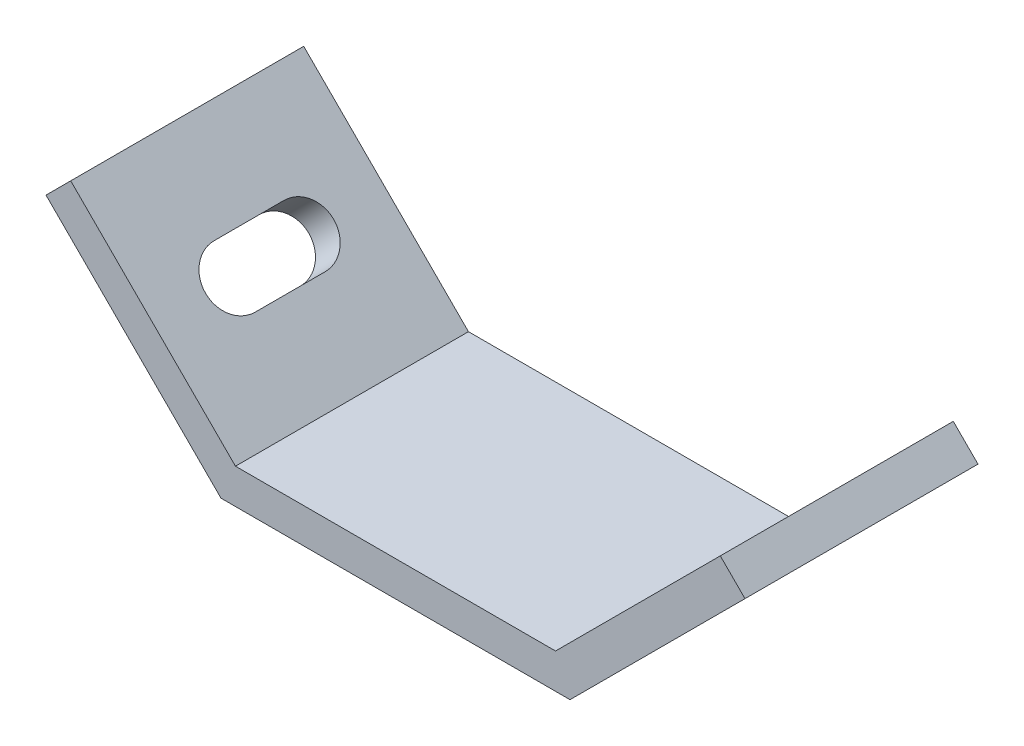
ISO-10303-21;
HEADER;
FILE_DESCRIPTION(('STEP AP214'),'2;1');
FILE_NAME('part.step','',(''),(''),'','','');
FILE_SCHEMA(('AUTOMOTIVE_DESIGN { 1 0 10303 214 1 1 1 1 }'));
ENDSEC;
DATA;
#1=APPLICATION_CONTEXT('core data for automotive mechanical design processes');
#2=APPLICATION_PROTOCOL_DEFINITION('international standard','automotive_design',2000,#1);
#3=PRODUCT_CONTEXT('',#1,'mechanical');
#4=PRODUCT('Part','Part','',(#3));
#5=PRODUCT_RELATED_PRODUCT_CATEGORY('part','',(#4));
#6=PRODUCT_DEFINITION_FORMATION('','',#4);
#7=PRODUCT_DEFINITION_CONTEXT('part definition',#1,'design');
#8=PRODUCT_DEFINITION('design','',#6,#7);
#9=PRODUCT_DEFINITION_SHAPE('','',#8);
#10=(LENGTH_UNIT() NAMED_UNIT(*) SI_UNIT(.MILLI.,.METRE.));
#11=(NAMED_UNIT(*) PLANE_ANGLE_UNIT() SI_UNIT($,.RADIAN.));
#12=(NAMED_UNIT(*) SI_UNIT($,.STERADIAN.) SOLID_ANGLE_UNIT());
#13=UNCERTAINTY_MEASURE_WITH_UNIT(LENGTH_MEASURE(1.E-05),#10,'distance_accuracy_value','');
#14=(GEOMETRIC_REPRESENTATION_CONTEXT(3) GLOBAL_UNCERTAINTY_ASSIGNED_CONTEXT((#13)) GLOBAL_UNIT_ASSIGNED_CONTEXT((#10,
#11,#12)) REPRESENTATION_CONTEXT('',''));
#15=CARTESIAN_POINT('',(0.,0.,0.));
#16=DIRECTION('',(0.,0.,1.));
#17=DIRECTION('',(1.,0.,0.));
#18=AXIS2_PLACEMENT_3D('',#15,#16,#17);
#19=CARTESIAN_POINT('',(15.8578643762691,-2.12132034355965,20.));
#20=DIRECTION('',(-0.707106781186546,0.707106781186549,0.));
#21=DIRECTION('',(-0.707106781186549,-0.707106781186546,0.));
#22=AXIS2_PLACEMENT_3D('',#19,#20,#21);
#23=PLANE('',#22);
#24=DIRECTION('',(0.707106781186549,0.707106781186546,0.));
#25=VECTOR('',#24,1.);
#26=CARTESIAN_POINT('',(15.8578643762691,-2.12132034355965,0.));
#27=LINE('',#26,#25);
#28=CARTESIAN_POINT('',(14.9791847198287,-3.,0.));
#29=VERTEX_POINT('',#28);
#30=CARTESIAN_POINT('',(30.,12.0208152801712,0.));
#31=VERTEX_POINT('',#30);
#32=EDGE_CURVE('E175',#29,#31,#27,.T.);
#33=ORIENTED_EDGE('',*,*,#32,.T.);
#34=DIRECTION('',(0.,0.,-1.));
#35=VECTOR('',#34,1.);
#36=CARTESIAN_POINT('',(30.,12.0208152801712,20.));
#37=LINE('',#36,#35);
#38=CARTESIAN_POINT('',(30.,12.0208152801712,20.));
#39=VERTEX_POINT('',#38);
#40=EDGE_CURVE('E240',#39,#31,#37,.T.);
#41=ORIENTED_EDGE('',*,*,#40,.F.);
#42=DIRECTION('',(0.707106781186549,0.707106781186546,0.));
#43=VECTOR('',#42,1.);
#44=CARTESIAN_POINT('',(15.8578643762691,-2.12132034355965,20.));
#45=LINE('',#44,#43);
#46=CARTESIAN_POINT('',(14.9791847198287,-3.,20.));
#47=VERTEX_POINT('',#46);
#48=EDGE_CURVE('E182',#47,#39,#45,.T.);
#49=ORIENTED_EDGE('',*,*,#48,.F.);
#50=DIRECTION('',(0.,0.,-1.));
#51=VECTOR('',#50,1.);
#52=CARTESIAN_POINT('',(14.9791847198287,-3.,20.));
#53=LINE('',#52,#51);
#54=EDGE_CURVE('E204',#47,#29,#53,.T.);
#55=ORIENTED_EDGE('',*,*,#54,.T.);
#56=EDGE_LOOP('',(#33,#41,#49,#55));
#57=FACE_BOUND('',#56,.T.);
#58=CARTESIAN_POINT('',(22.9289321881345,4.94974746830579,7.));
#59=DIRECTION('',(-0.707106781186546,0.707106781186549,0.));
#60=DIRECTION('',(-0.707106781186549,-0.707106781186546,0.));
#61=AXIS2_PLACEMENT_3D('',#58,#59,#60);
#62=CIRCLE('',#61,2.5);
#63=CARTESIAN_POINT('',(21.1611652351682,3.18198051533942,7.));
#64=VERTEX_POINT('',#63);
#65=CARTESIAN_POINT('',(24.6966991411009,6.71751442127216,7.));
#66=VERTEX_POINT('',#65);
#67=EDGE_CURVE('E159',#64,#66,#62,.F.);
#68=ORIENTED_EDGE('',*,*,#67,.F.);
#69=DIRECTION('',(0.,0.,-1.));
#70=VECTOR('',#69,1.);
#71=CARTESIAN_POINT('',(21.1611652351682,3.18198051533942,20.));
#72=LINE('',#71,#70);
#73=CARTESIAN_POINT('',(21.1611652351682,3.18198051533942,13.));
#74=VERTEX_POINT('',#73);
#75=EDGE_CURVE('E152',#74,#64,#72,.T.);
#76=ORIENTED_EDGE('',*,*,#75,.F.);
#77=CARTESIAN_POINT('',(22.9289321881345,4.94974746830579,13.));
#78=DIRECTION('',(-0.707106781186546,0.707106781186549,0.));
#79=DIRECTION('',(-0.707106781186549,-0.707106781186546,0.));
#80=AXIS2_PLACEMENT_3D('',#77,#78,#79);
#81=CIRCLE('',#80,2.5);
#82=CARTESIAN_POINT('',(24.6966991411009,6.71751442127216,13.));
#83=VERTEX_POINT('',#82);
#84=EDGE_CURVE('E133',#83,#74,#81,.F.);
#85=ORIENTED_EDGE('',*,*,#84,.F.);
#86=DIRECTION('',(0.,0.,1.));
#87=VECTOR('',#86,1.);
#88=CARTESIAN_POINT('',(24.6966991411009,6.71751442127216,20.));
#89=LINE('',#88,#87);
#90=EDGE_CURVE('E157',#66,#83,#89,.T.);
#91=ORIENTED_EDGE('',*,*,#90,.F.);
#92=EDGE_LOOP('',(#68,#76,#85,#91));
#93=FACE_BOUND('',#92,.T.);
#94=ADVANCED_FACE('F15',(#57,#93),#23,.F.);
#95=CARTESIAN_POINT('',(13.7365440327094,0.,20.));
#96=DIRECTION('',(-0.707106781186546,0.707106781186549,0.));
#97=DIRECTION('',(-0.707106781186549,-0.707106781186546,0.));
#98=AXIS2_PLACEMENT_3D('',#95,#96,#97);
#99=PLANE('',#98);
#100=DIRECTION('',(0.707106781186549,0.707106781186546,0.));
#101=VECTOR('',#100,1.);
#102=CARTESIAN_POINT('',(13.7365440327094,0.,0.));
#103=LINE('',#102,#101);
#104=CARTESIAN_POINT('',(13.7365440327094,0.,0.));
#105=VERTEX_POINT('',#104);
#106=CARTESIAN_POINT('',(27.8786796564404,14.1421356237309,0.));
#107=VERTEX_POINT('',#106);
#108=EDGE_CURVE('E210',#105,#107,#103,.T.);
#109=ORIENTED_EDGE('',*,*,#108,.F.);
#110=DIRECTION('',(0.,0.,-1.));
#111=VECTOR('',#110,1.);
#112=CARTESIAN_POINT('',(13.7365440327094,0.,20.));
#113=LINE('',#112,#111);
#114=CARTESIAN_POINT('',(13.7365440327094,0.,20.));
#115=VERTEX_POINT('',#114);
#116=EDGE_CURVE('E236',#115,#105,#113,.T.);
#117=ORIENTED_EDGE('',*,*,#116,.F.);
#118=DIRECTION('',(0.707106781186549,0.707106781186546,0.));
#119=VECTOR('',#118,1.);
#120=CARTESIAN_POINT('',(13.7365440327094,0.,20.));
#121=LINE('',#120,#119);
#122=CARTESIAN_POINT('',(27.8786796564404,14.1421356237309,20.));
#123=VERTEX_POINT('',#122);
#124=EDGE_CURVE('E188',#115,#123,#121,.T.);
#125=ORIENTED_EDGE('',*,*,#124,.T.);
#126=DIRECTION('',(0.,0.,-1.));
#127=VECTOR('',#126,1.);
#128=CARTESIAN_POINT('',(27.8786796564404,14.1421356237309,20.));
#129=LINE('',#128,#127);
#130=EDGE_CURVE('E238',#123,#107,#129,.T.);
#131=ORIENTED_EDGE('',*,*,#130,.T.);
#132=EDGE_LOOP('',(#109,#117,#125,#131));
#133=FACE_BOUND('',#132,.T.);
#134=DIRECTION('',(0.,0.,-1.));
#135=VECTOR('',#134,1.);
#136=CARTESIAN_POINT('',(19.0398448916085,5.30330085889907,7.));
#137=LINE('',#136,#135);
#138=CARTESIAN_POINT('',(19.0398448916085,5.30330085889907,13.));
#139=VERTEX_POINT('',#138);
#140=CARTESIAN_POINT('',(19.0398448916085,5.30330085889906,7.));
#141=VERTEX_POINT('',#140);
#142=EDGE_CURVE('E139',#139,#141,#137,.T.);
#143=ORIENTED_EDGE('',*,*,#142,.T.);
#144=CARTESIAN_POINT('',(20.8076118445749,7.07106781186544,7.));
#145=DIRECTION('',(0.707106781186546,-0.707106781186549,0.));
#146=DIRECTION('',(0.707106781186549,0.707106781186546,0.));
#147=AXIS2_PLACEMENT_3D('',#144,#145,#146);
#148=CIRCLE('',#147,2.5);
#149=CARTESIAN_POINT('',(22.5753787975413,8.8388347648318,7.));
#150=VERTEX_POINT('',#149);
#151=EDGE_CURVE('E37',#141,#150,#148,.T.);
#152=ORIENTED_EDGE('',*,*,#151,.T.);
#153=DIRECTION('',(0.,0.,1.));
#154=VECTOR('',#153,1.);
#155=CARTESIAN_POINT('',(22.5753787975413,8.8388347648318,7.));
#156=LINE('',#155,#154);
#157=CARTESIAN_POINT('',(22.5753787975413,8.83883476483181,13.));
#158=VERTEX_POINT('',#157);
#159=EDGE_CURVE('E145',#150,#158,#156,.T.);
#160=ORIENTED_EDGE('',*,*,#159,.T.);
#161=CARTESIAN_POINT('',(20.8076118445749,7.07106781186544,13.));
#162=DIRECTION('',(0.707106781186546,-0.707106781186549,0.));
#163=DIRECTION('',(0.707106781186549,0.707106781186546,0.));
#164=AXIS2_PLACEMENT_3D('',#161,#162,#163);
#165=CIRCLE('',#164,2.5);
#166=EDGE_CURVE('E130',#158,#139,#165,.T.);
#167=ORIENTED_EDGE('',*,*,#166,.T.);
#168=EDGE_LOOP('',(#143,#152,#160,#167));
#169=FACE_BOUND('',#168,.T.);
#170=ADVANCED_FACE('F143',(#133,#169),#99,.T.);
#171=CARTESIAN_POINT('',(27.8786796564404,14.1421356237309,20.));
#172=DIRECTION('',(0.707106781186549,0.707106781186546,0.));
#173=DIRECTION('',(-0.707106781186546,0.707106781186549,0.));
#174=AXIS2_PLACEMENT_3D('',#171,#172,#173);
#175=PLANE('',#174);
#176=DIRECTION('',(0.707106781186546,-0.707106781186549,0.));
#177=VECTOR('',#176,1.);
#178=CARTESIAN_POINT('',(27.8786796564404,14.1421356237309,0.));
#179=LINE('',#178,#177);
#180=EDGE_CURVE('E207',#107,#31,#179,.T.);
#181=ORIENTED_EDGE('',*,*,#180,.F.);
#182=ORIENTED_EDGE('',*,*,#130,.F.);
#183=DIRECTION('',(0.707106781186546,-0.707106781186549,0.));
#184=VECTOR('',#183,1.);
#185=CARTESIAN_POINT('',(27.8786796564404,14.1421356237309,20.));
#186=LINE('',#185,#184);
#187=EDGE_CURVE('E184',#123,#39,#186,.T.);
#188=ORIENTED_EDGE('',*,*,#187,.T.);
#189=ORIENTED_EDGE('',*,*,#40,.T.);
#190=EDGE_LOOP('',(#181,#182,#188,#189));
#191=FACE_BOUND('',#190,.T.);
#192=ADVANCED_FACE('F287',(#191),#175,.T.);
#193=CARTESIAN_POINT('',(-13.7365440327094,0.,20.));
#194=DIRECTION('',(0.,1.,0.));
#195=DIRECTION('',(-1.,0.,0.));
#196=AXIS2_PLACEMENT_3D('',#193,#194,#195);
#197=PLANE('',#196);
#198=DIRECTION('',(1.,0.,0.));
#199=VECTOR('',#198,1.);
#200=CARTESIAN_POINT('',(-13.7365440327094,0.,0.));
#201=LINE('',#200,#199);
#202=CARTESIAN_POINT('',(-13.7365440327094,0.,0.));
#203=VERTEX_POINT('',#202);
#204=EDGE_CURVE('E213',#203,#105,#201,.T.);
#205=ORIENTED_EDGE('',*,*,#204,.F.);
#206=DIRECTION('',(0.,0.,-1.));
#207=VECTOR('',#206,1.);
#208=CARTESIAN_POINT('',(-13.7365440327094,0.,20.));
#209=LINE('',#208,#207);
#210=CARTESIAN_POINT('',(-13.7365440327094,0.,20.));
#211=VERTEX_POINT('',#210);
#212=EDGE_CURVE('E234',#211,#203,#209,.T.);
#213=ORIENTED_EDGE('',*,*,#212,.F.);
#214=DIRECTION('',(1.,0.,0.));
#215=VECTOR('',#214,1.);
#216=CARTESIAN_POINT('',(-13.7365440327094,0.,20.));
#217=LINE('',#216,#215);
#218=EDGE_CURVE('E191',#211,#115,#217,.T.);
#219=ORIENTED_EDGE('',*,*,#218,.T.);
#220=ORIENTED_EDGE('',*,*,#116,.T.);
#221=EDGE_LOOP('',(#205,#213,#219,#220));
#222=FACE_BOUND('',#221,.T.);
#223=ADVANCED_FACE('F333',(#222),#197,.T.);
#224=CARTESIAN_POINT('',(-13.7365440327094,0.,20.));
#225=DIRECTION('',(0.707106781186546,0.707106781186549,0.));
#226=DIRECTION('',(-0.707106781186549,0.707106781186546,0.));
#227=AXIS2_PLACEMENT_3D('',#224,#225,#226);
#228=PLANE('',#227);
#229=CARTESIAN_POINT('',(-20.8076118445749,7.07106781186544,7.));
#230=DIRECTION('',(0.707106781186546,0.707106781186549,0.));
#231=DIRECTION('',(-0.707106781186549,0.707106781186546,0.));
#232=AXIS2_PLACEMENT_3D('',#229,#230,#231);
#233=CIRCLE('',#232,2.5);
#234=CARTESIAN_POINT('',(-19.0398448916085,5.30330085889907,7.));
#235=VERTEX_POINT('',#234);
#236=CARTESIAN_POINT('',(-22.5753787975413,8.8388347648318,7.));
#237=VERTEX_POINT('',#236);
#238=EDGE_CURVE('E161',#235,#237,#233,.T.);
#239=ORIENTED_EDGE('',*,*,#238,.F.);
#240=DIRECTION('',(0.,0.,-1.));
#241=VECTOR('',#240,1.);
#242=CARTESIAN_POINT('',(-19.0398448916085,5.30330085889907,7.));
#243=LINE('',#242,#241);
#244=CARTESIAN_POINT('',(-19.0398448916085,5.30330085889907,13.));
#245=VERTEX_POINT('',#244);
#246=EDGE_CURVE('E169',#245,#235,#243,.T.);
#247=ORIENTED_EDGE('',*,*,#246,.F.);
#248=CARTESIAN_POINT('',(-20.8076118445749,7.07106781186544,13.));
#249=DIRECTION('',(0.707106781186546,0.707106781186549,0.));
#250=DIRECTION('',(-0.707106781186549,0.707106781186546,0.));
#251=AXIS2_PLACEMENT_3D('',#248,#249,#250);
#252=CIRCLE('',#251,2.5);
#253=CARTESIAN_POINT('',(-22.5753787975413,8.83883476483181,13.));
#254=VERTEX_POINT('',#253);
#255=EDGE_CURVE('E166',#254,#245,#252,.T.);
#256=ORIENTED_EDGE('',*,*,#255,.F.);
#257=DIRECTION('',(0.,0.,1.));
#258=VECTOR('',#257,1.);
#259=CARTESIAN_POINT('',(-22.5753787975413,8.8388347648318,7.));
#260=LINE('',#259,#258);
#261=EDGE_CURVE('E163',#237,#254,#260,.T.);
#262=ORIENTED_EDGE('',*,*,#261,.F.);
#263=EDGE_LOOP('',(#239,#247,#256,#262));
#264=FACE_BOUND('',#263,.T.);
#265=DIRECTION('',(0.707106781186549,-0.707106781186546,0.));
#266=VECTOR('',#265,1.);
#267=CARTESIAN_POINT('',(-13.7365440327094,0.,0.));
#268=LINE('',#267,#266);
#269=CARTESIAN_POINT('',(-27.8786796564404,14.1421356237309,0.));
#270=VERTEX_POINT('',#269);
#271=EDGE_CURVE('E216',#270,#203,#268,.T.);
#272=ORIENTED_EDGE('',*,*,#271,.F.);
#273=DIRECTION('',(0.,0.,-1.));
#274=VECTOR('',#273,1.);
#275=CARTESIAN_POINT('',(-27.8786796564404,14.1421356237309,20.));
#276=LINE('',#275,#274);
#277=CARTESIAN_POINT('',(-27.8786796564404,14.1421356237309,20.));
#278=VERTEX_POINT('',#277);
#279=EDGE_CURVE('E232',#278,#270,#276,.T.);
#280=ORIENTED_EDGE('',*,*,#279,.F.);
#281=DIRECTION('',(0.707106781186549,-0.707106781186546,0.));
#282=VECTOR('',#281,1.);
#283=CARTESIAN_POINT('',(-13.7365440327094,0.,20.));
#284=LINE('',#283,#282);
#285=EDGE_CURVE('E194',#278,#211,#284,.T.);
#286=ORIENTED_EDGE('',*,*,#285,.T.);
#287=ORIENTED_EDGE('',*,*,#212,.T.);
#288=EDGE_LOOP('',(#272,#280,#286,#287));
#289=FACE_BOUND('',#288,.T.);
#290=ADVANCED_FACE('F263',(#264,#289),#228,.T.);
#291=CARTESIAN_POINT('',(-30.,12.0208152801712,20.));
#292=DIRECTION('',(-0.707106781186549,0.707106781186546,0.));
#293=DIRECTION('',(-0.707106781186546,-0.707106781186549,0.));
#294=AXIS2_PLACEMENT_3D('',#291,#292,#293);
#295=PLANE('',#294);
#296=DIRECTION('',(0.707106781186546,0.707106781186549,0.));
#297=VECTOR('',#296,1.);
#298=CARTESIAN_POINT('',(-30.,12.0208152801712,0.));
#299=LINE('',#298,#297);
#300=CARTESIAN_POINT('',(-30.,12.0208152801712,0.));
#301=VERTEX_POINT('',#300);
#302=EDGE_CURVE('E219',#301,#270,#299,.T.);
#303=ORIENTED_EDGE('',*,*,#302,.F.);
#304=DIRECTION('',(0.,0.,-1.));
#305=VECTOR('',#304,1.);
#306=CARTESIAN_POINT('',(-30.,12.0208152801712,20.));
#307=LINE('',#306,#305);
#308=CARTESIAN_POINT('',(-30.,12.0208152801712,20.));
#309=VERTEX_POINT('',#308);
#310=EDGE_CURVE('E230',#309,#301,#307,.T.);
#311=ORIENTED_EDGE('',*,*,#310,.F.);
#312=DIRECTION('',(0.707106781186546,0.707106781186549,0.));
#313=VECTOR('',#312,1.);
#314=CARTESIAN_POINT('',(-30.,12.0208152801712,20.));
#315=LINE('',#314,#313);
#316=EDGE_CURVE('E197',#309,#278,#315,.T.);
#317=ORIENTED_EDGE('',*,*,#316,.T.);
#318=ORIENTED_EDGE('',*,*,#279,.T.);
#319=EDGE_LOOP('',(#303,#311,#317,#318));
#320=FACE_BOUND('',#319,.T.);
#321=ADVANCED_FACE('F327',(#320),#295,.T.);
#322=CARTESIAN_POINT('',(-15.8578643762691,-2.12132034355965,20.));
#323=DIRECTION('',(0.707106781186546,0.707106781186549,0.));
#324=DIRECTION('',(-0.707106781186549,0.707106781186546,0.));
#325=AXIS2_PLACEMENT_3D('',#322,#323,#324);
#326=PLANE('',#325);
#327=DIRECTION('',(0.,0.,-1.));
#328=VECTOR('',#327,1.);
#329=CARTESIAN_POINT('',(-21.1611652351682,3.18198051533942,20.));
#330=LINE('',#329,#328);
#331=CARTESIAN_POINT('',(-21.1611652351682,3.18198051533942,13.));
#332=VERTEX_POINT('',#331);
#333=CARTESIAN_POINT('',(-21.1611652351682,3.18198051533942,7.));
#334=VERTEX_POINT('',#333);
#335=EDGE_CURVE('E22',#332,#334,#330,.T.);
#336=ORIENTED_EDGE('',*,*,#335,.T.);
#337=CARTESIAN_POINT('',(-22.9289321881345,4.94974746830579,7.));
#338=DIRECTION('',(0.707106781186546,0.707106781186549,0.));
#339=DIRECTION('',(-0.707106781186549,0.707106781186546,0.));
#340=AXIS2_PLACEMENT_3D('',#337,#338,#339);
#341=CIRCLE('',#340,2.5);
#342=CARTESIAN_POINT('',(-24.6966991411009,6.71751442127216,7.));
#343=VERTEX_POINT('',#342);
#344=EDGE_CURVE('E10',#334,#343,#341,.T.);
#345=ORIENTED_EDGE('',*,*,#344,.T.);
#346=DIRECTION('',(0.,0.,1.));
#347=VECTOR('',#346,1.);
#348=CARTESIAN_POINT('',(-24.6966991411009,6.71751442127216,20.));
#349=LINE('',#348,#347);
#350=CARTESIAN_POINT('',(-24.6966991411009,6.71751442127216,13.));
#351=VERTEX_POINT('',#350);
#352=EDGE_CURVE('E242',#343,#351,#349,.T.);
#353=ORIENTED_EDGE('',*,*,#352,.T.);
#354=CARTESIAN_POINT('',(-22.9289321881345,4.94974746830579,13.));
#355=DIRECTION('',(0.707106781186546,0.707106781186549,0.));
#356=DIRECTION('',(-0.707106781186549,0.707106781186546,0.));
#357=AXIS2_PLACEMENT_3D('',#354,#355,#356);
#358=CIRCLE('',#357,2.5);
#359=EDGE_CURVE('E245',#351,#332,#358,.T.);
#360=ORIENTED_EDGE('',*,*,#359,.T.);
#361=EDGE_LOOP('',(#336,#345,#353,#360));
#362=FACE_BOUND('',#361,.T.);
#363=DIRECTION('',(0.707106781186549,-0.707106781186546,0.));
#364=VECTOR('',#363,1.);
#365=CARTESIAN_POINT('',(-15.8578643762691,-2.12132034355965,0.));
#366=LINE('',#365,#364);
#367=CARTESIAN_POINT('',(-14.9791847198287,-3.,0.));
#368=VERTEX_POINT('',#367);
#369=EDGE_CURVE('E222',#301,#368,#366,.T.);
#370=ORIENTED_EDGE('',*,*,#369,.T.);
#371=DIRECTION('',(0.,0.,-1.));
#372=VECTOR('',#371,1.);
#373=CARTESIAN_POINT('',(-14.9791847198287,-3.,20.));
#374=LINE('',#373,#372);
#375=CARTESIAN_POINT('',(-14.9791847198287,-3.,20.));
#376=VERTEX_POINT('',#375);
#377=EDGE_CURVE('E227',#376,#368,#374,.T.);
#378=ORIENTED_EDGE('',*,*,#377,.F.);
#379=DIRECTION('',(0.707106781186549,-0.707106781186546,0.));
#380=VECTOR('',#379,1.);
#381=CARTESIAN_POINT('',(-15.8578643762691,-2.12132034355965,20.));
#382=LINE('',#381,#380);
#383=EDGE_CURVE('E200',#309,#376,#382,.T.);
#384=ORIENTED_EDGE('',*,*,#383,.F.);
#385=ORIENTED_EDGE('',*,*,#310,.T.);
#386=EDGE_LOOP('',(#370,#378,#384,#385));
#387=FACE_BOUND('',#386,.T.);
#388=ADVANCED_FACE('F249',(#362,#387),#326,.F.);
#389=CARTESIAN_POINT('',(-13.7365440327094,-3.,20.));
#390=DIRECTION('',(0.,1.,0.));
#391=DIRECTION('',(-1.,0.,0.));
#392=AXIS2_PLACEMENT_3D('',#389,#390,#391);
#393=PLANE('',#392);
#394=DIRECTION('',(1.,0.,0.));
#395=VECTOR('',#394,1.);
#396=CARTESIAN_POINT('',(-13.7365440327094,-3.,0.));
#397=LINE('',#396,#395);
#398=EDGE_CURVE('E185',#368,#29,#397,.T.);
#399=ORIENTED_EDGE('',*,*,#398,.T.);
#400=ORIENTED_EDGE('',*,*,#54,.F.);
#401=DIRECTION('',(1.,0.,0.));
#402=VECTOR('',#401,1.);
#403=CARTESIAN_POINT('',(-13.7365440327094,-3.,20.));
#404=LINE('',#403,#402);
#405=EDGE_CURVE('E202',#376,#47,#404,.T.);
#406=ORIENTED_EDGE('',*,*,#405,.F.);
#407=ORIENTED_EDGE('',*,*,#377,.T.);
#408=EDGE_LOOP('',(#399,#400,#406,#407));
#409=FACE_BOUND('',#408,.T.);
#410=ADVANCED_FACE('F319',(#409),#393,.F.);
#411=CARTESIAN_POINT('',(0.,0.,20.));
#412=DIRECTION('',(0.,0.,-1.));
#413=DIRECTION('',(-1.,0.,0.));
#414=AXIS2_PLACEMENT_3D('',#411,#412,#413);
#415=PLANE('',#414);
#416=ORIENTED_EDGE('',*,*,#48,.T.);
#417=ORIENTED_EDGE('',*,*,#187,.F.);
#418=ORIENTED_EDGE('',*,*,#124,.F.);
#419=ORIENTED_EDGE('',*,*,#218,.F.);
#420=ORIENTED_EDGE('',*,*,#285,.F.);
#421=ORIENTED_EDGE('',*,*,#316,.F.);
#422=ORIENTED_EDGE('',*,*,#383,.T.);
#423=ORIENTED_EDGE('',*,*,#405,.T.);
#424=EDGE_LOOP('',(#416,#417,#418,#419,#420,#421,#422,#423));
#425=FACE_BOUND('',#424,.T.);
#426=ADVANCED_FACE('F314',(#425),#415,.F.);
#427=CARTESIAN_POINT('',(0.,0.,0.));
#428=DIRECTION('',(0.,0.,-1.));
#429=DIRECTION('',(-1.,0.,0.));
#430=AXIS2_PLACEMENT_3D('',#427,#428,#429);
#431=PLANE('',#430);
#432=ORIENTED_EDGE('',*,*,#32,.F.);
#433=ORIENTED_EDGE('',*,*,#398,.F.);
#434=ORIENTED_EDGE('',*,*,#369,.F.);
#435=ORIENTED_EDGE('',*,*,#302,.T.);
#436=ORIENTED_EDGE('',*,*,#271,.T.);
#437=ORIENTED_EDGE('',*,*,#204,.T.);
#438=ORIENTED_EDGE('',*,*,#108,.T.);
#439=ORIENTED_EDGE('',*,*,#180,.T.);
#440=EDGE_LOOP('',(#432,#433,#434,#435,#436,#437,#438,#439));
#441=FACE_BOUND('',#440,.T.);
#442=ADVANCED_FACE('F310',(#441),#431,.T.);
#443=CARTESIAN_POINT('',(-30.4393398282201,-2.56066017177985,7.));
#444=DIRECTION('',(0.707106781186546,0.707106781186549,0.));
#445=DIRECTION('',(-0.707106781186549,0.707106781186546,0.));
#446=AXIS2_PLACEMENT_3D('',#443,#444,#445);
#447=CYLINDRICAL_SURFACE('',#446,2.5);
#448=DIRECTION('',(0.707106781186546,0.707106781186549,0.));
#449=VECTOR('',#448,1.);
#450=CARTESIAN_POINT('',(-28.6715728752538,-4.32842712474622,7.));
#451=LINE('',#450,#449);
#452=EDGE_CURVE('E173',#334,#235,#451,.T.);
#453=ORIENTED_EDGE('',*,*,#452,.T.);
#454=ORIENTED_EDGE('',*,*,#238,.T.);
#455=DIRECTION('',(0.707106781186546,0.707106781186549,0.));
#456=VECTOR('',#455,1.);
#457=CARTESIAN_POINT('',(-32.2071067811865,-0.792893218813486,7.));
#458=LINE('',#457,#456);
#459=EDGE_CURVE('E172',#343,#237,#458,.T.);
#460=ORIENTED_EDGE('',*,*,#459,.F.);
#461=ORIENTED_EDGE('',*,*,#344,.F.);
#462=EDGE_LOOP('',(#453,#454,#460,#461));
#463=FACE_BOUND('',#462,.T.);
#464=ADVANCED_FACE('F267',(#463),#447,.F.);
#465=CARTESIAN_POINT('',(-28.6715728752538,-4.32842712474622,7.));
#466=DIRECTION('',(0.707106781186549,-0.707106781186546,0.));
#467=DIRECTION('',(0.707106781186546,0.707106781186549,0.));
#468=AXIS2_PLACEMENT_3D('',#465,#466,#467);
#469=PLANE('',#468);
#470=DIRECTION('',(0.707106781186546,0.707106781186549,0.));
#471=VECTOR('',#470,1.);
#472=CARTESIAN_POINT('',(-28.6715728752538,-4.32842712474622,13.));
#473=LINE('',#472,#471);
#474=EDGE_CURVE('E176',#332,#245,#473,.T.);
#475=ORIENTED_EDGE('',*,*,#474,.T.);
#476=ORIENTED_EDGE('',*,*,#246,.T.);
#477=ORIENTED_EDGE('',*,*,#452,.F.);
#478=ORIENTED_EDGE('',*,*,#335,.F.);
#479=EDGE_LOOP('',(#475,#476,#477,#478));
#480=FACE_BOUND('',#479,.T.);
#481=ADVANCED_FACE('F255',(#480),#469,.F.);
#482=CARTESIAN_POINT('',(-30.4393398282201,-2.56066017177985,13.));
#483=DIRECTION('',(0.707106781186546,0.707106781186549,0.));
#484=DIRECTION('',(-0.707106781186549,0.707106781186546,0.));
#485=AXIS2_PLACEMENT_3D('',#482,#483,#484);
#486=CYLINDRICAL_SURFACE('',#485,2.5);
#487=DIRECTION('',(0.707106781186546,0.707106781186549,0.));
#488=VECTOR('',#487,1.);
#489=CARTESIAN_POINT('',(-32.2071067811865,-0.792893218813481,13.));
#490=LINE('',#489,#488);
#491=EDGE_CURVE('E178',#351,#254,#490,.T.);
#492=ORIENTED_EDGE('',*,*,#491,.T.);
#493=ORIENTED_EDGE('',*,*,#255,.T.);
#494=ORIENTED_EDGE('',*,*,#474,.F.);
#495=ORIENTED_EDGE('',*,*,#359,.F.);
#496=EDGE_LOOP('',(#492,#493,#494,#495));
#497=FACE_BOUND('',#496,.T.);
#498=ADVANCED_FACE('F257',(#497),#486,.F.);
#499=CARTESIAN_POINT('',(-32.2071067811865,-0.792893218813486,7.));
#500=DIRECTION('',(-0.707106781186549,0.707106781186546,0.));
#501=DIRECTION('',(-0.707106781186546,-0.707106781186549,0.));
#502=AXIS2_PLACEMENT_3D('',#499,#500,#501);
#503=PLANE('',#502);
#504=ORIENTED_EDGE('',*,*,#459,.T.);
#505=ORIENTED_EDGE('',*,*,#261,.T.);
#506=ORIENTED_EDGE('',*,*,#491,.F.);
#507=ORIENTED_EDGE('',*,*,#352,.F.);
#508=EDGE_LOOP('',(#504,#505,#506,#507));
#509=FACE_BOUND('',#508,.T.);
#510=ADVANCED_FACE('F269',(#509),#503,.F.);
#511=CARTESIAN_POINT('',(30.4393398282201,-2.56066017177985,7.));
#512=DIRECTION('',(-0.707106781186546,0.707106781186549,0.));
#513=DIRECTION('',(-0.707106781186549,-0.707106781186546,0.));
#514=AXIS2_PLACEMENT_3D('',#511,#512,#513);
#515=CYLINDRICAL_SURFACE('',#514,2.5);
#516=ORIENTED_EDGE('',*,*,#67,.T.);
#517=DIRECTION('',(-0.707106781186546,0.707106781186549,0.));
#518=VECTOR('',#517,1.);
#519=CARTESIAN_POINT('',(32.2071067811865,-0.792893218813486,7.));
#520=LINE('',#519,#518);
#521=EDGE_CURVE('E150',#66,#150,#520,.T.);
#522=ORIENTED_EDGE('',*,*,#521,.T.);
#523=ORIENTED_EDGE('',*,*,#151,.F.);
#524=DIRECTION('',(-0.707106781186546,0.707106781186549,0.));
#525=VECTOR('',#524,1.);
#526=CARTESIAN_POINT('',(28.6715728752538,-4.32842712474622,7.));
#527=LINE('',#526,#525);
#528=EDGE_CURVE('E136',#64,#141,#527,.T.);
#529=ORIENTED_EDGE('',*,*,#528,.F.);
#530=EDGE_LOOP('',(#516,#522,#523,#529));
#531=FACE_BOUND('',#530,.T.);
#532=ADVANCED_FACE('F271',(#531),#515,.F.);
#533=CARTESIAN_POINT('',(32.2071067811865,-0.792893218813486,7.));
#534=DIRECTION('',(-0.707106781186549,-0.707106781186546,0.));
#535=DIRECTION('',(0.707106781186546,-0.707106781186549,0.));
#536=AXIS2_PLACEMENT_3D('',#533,#534,#535);
#537=PLANE('',#536);
#538=ORIENTED_EDGE('',*,*,#90,.T.);
#539=DIRECTION('',(-0.707106781186546,0.707106781186549,0.));
#540=VECTOR('',#539,1.);
#541=CARTESIAN_POINT('',(32.2071067811865,-0.792893218813481,13.));
#542=LINE('',#541,#540);
#543=EDGE_CURVE('E135',#83,#158,#542,.T.);
#544=ORIENTED_EDGE('',*,*,#543,.T.);
#545=ORIENTED_EDGE('',*,*,#159,.F.);
#546=ORIENTED_EDGE('',*,*,#521,.F.);
#547=EDGE_LOOP('',(#538,#544,#545,#546));
#548=FACE_BOUND('',#547,.T.);
#549=ADVANCED_FACE('F278',(#548),#537,.T.);
#550=CARTESIAN_POINT('',(30.4393398282201,-2.56066017177985,13.));
#551=DIRECTION('',(-0.707106781186546,0.707106781186549,0.));
#552=DIRECTION('',(-0.707106781186549,-0.707106781186546,0.));
#553=AXIS2_PLACEMENT_3D('',#550,#551,#552);
#554=CYLINDRICAL_SURFACE('',#553,2.5);
#555=ORIENTED_EDGE('',*,*,#84,.T.);
#556=DIRECTION('',(-0.707106781186546,0.707106781186549,0.));
#557=VECTOR('',#556,1.);
#558=CARTESIAN_POINT('',(28.6715728752538,-4.32842712474622,13.));
#559=LINE('',#558,#557);
#560=EDGE_CURVE('E29',#74,#139,#559,.T.);
#561=ORIENTED_EDGE('',*,*,#560,.T.);
#562=ORIENTED_EDGE('',*,*,#166,.F.);
#563=ORIENTED_EDGE('',*,*,#543,.F.);
#564=EDGE_LOOP('',(#555,#561,#562,#563));
#565=FACE_BOUND('',#564,.T.);
#566=ADVANCED_FACE('F127',(#565),#554,.F.);
#567=CARTESIAN_POINT('',(28.6715728752538,-4.32842712474622,7.));
#568=DIRECTION('',(0.707106781186549,0.707106781186546,0.));
#569=DIRECTION('',(-0.707106781186546,0.707106781186549,0.));
#570=AXIS2_PLACEMENT_3D('',#567,#568,#569);
#571=PLANE('',#570);
#572=ORIENTED_EDGE('',*,*,#75,.T.);
#573=ORIENTED_EDGE('',*,*,#528,.T.);
#574=ORIENTED_EDGE('',*,*,#142,.F.);
#575=ORIENTED_EDGE('',*,*,#560,.F.);
#576=EDGE_LOOP('',(#572,#573,#574,#575));
#577=FACE_BOUND('',#576,.T.);
#578=ADVANCED_FACE('F140',(#577),#571,.T.);
#579=CLOSED_SHELL('',(#94,#170,#192,#223,#290,#321,#388,#410,#426,#442,#464,#481,#498,#510,#532,
#549,#566,#578));
#580=MANIFOLD_SOLID_BREP('B1',#579);
#581=ADVANCED_BREP_SHAPE_REPRESENTATION('',(#18,#580),#14);
#582=SHAPE_DEFINITION_REPRESENTATION(#9,#581);
ENDSEC;
END-ISO-10303-21;
